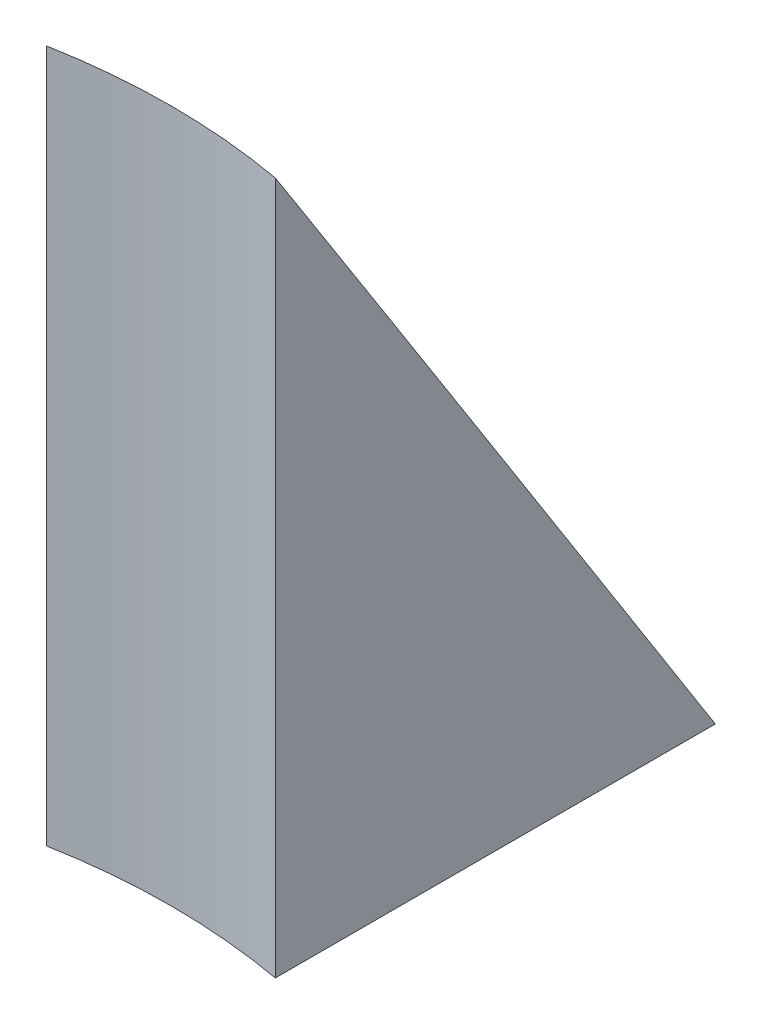
ISO-10303-21;
HEADER;
FILE_DESCRIPTION(('STEP AP214'),'2;1');
FILE_NAME('part.step','',(''),(''),'','','');
FILE_SCHEMA(('AUTOMOTIVE_DESIGN { 1 0 10303 214 1 1 1 1 }'));
ENDSEC;
DATA;
#1=APPLICATION_CONTEXT('core data for automotive mechanical design processes');
#2=APPLICATION_PROTOCOL_DEFINITION('international standard','automotive_design',2000,#1);
#3=PRODUCT_CONTEXT('',#1,'mechanical');
#4=PRODUCT('Part','Part','',(#3));
#5=PRODUCT_RELATED_PRODUCT_CATEGORY('part','',(#4));
#6=PRODUCT_DEFINITION_FORMATION('','',#4);
#7=PRODUCT_DEFINITION_CONTEXT('part definition',#1,'design');
#8=PRODUCT_DEFINITION('design','',#6,#7);
#9=PRODUCT_DEFINITION_SHAPE('','',#8);
#10=(LENGTH_UNIT() NAMED_UNIT(*) SI_UNIT(.MILLI.,.METRE.));
#11=(NAMED_UNIT(*) PLANE_ANGLE_UNIT() SI_UNIT($,.RADIAN.));
#12=(NAMED_UNIT(*) SI_UNIT($,.STERADIAN.) SOLID_ANGLE_UNIT());
#13=UNCERTAINTY_MEASURE_WITH_UNIT(LENGTH_MEASURE(1.E-05),#10,'distance_accuracy_value','');
#14=(GEOMETRIC_REPRESENTATION_CONTEXT(3) GLOBAL_UNCERTAINTY_ASSIGNED_CONTEXT((#13)) GLOBAL_UNIT_ASSIGNED_CONTEXT((#10,
#11,#12)) REPRESENTATION_CONTEXT('',''));
#15=CARTESIAN_POINT('',(0.,0.,0.));
#16=DIRECTION('',(0.,0.,1.));
#17=DIRECTION('',(1.,0.,0.));
#18=AXIS2_PLACEMENT_3D('',#15,#16,#17);
#19=CARTESIAN_POINT('',(75.,0.,0.));
#20=DIRECTION('',(0.,-1.,0.));
#21=DIRECTION('',(0.,0.,-1.));
#22=AXIS2_PLACEMENT_3D('',#19,#20,#21);
#23=PLANE('',#22);
#24=CARTESIAN_POINT('',(0.,0.,0.));
#25=DIRECTION('',(0.,-1.,0.));
#26=DIRECTION('',(0.,0.,-1.));
#27=AXIS2_PLACEMENT_3D('',#24,#25,#26);
#28=CIRCLE('',#27,75.);
#29=CARTESIAN_POINT('',(-7.99999999999999,0.,-74.5721127500086));
#30=VERTEX_POINT('',#29);
#31=CARTESIAN_POINT('',(8.00000000000002,0.,-74.5721127500086));
#32=VERTEX_POINT('',#31);
#33=EDGE_CURVE('E89',#30,#32,#28,.T.);
#34=ORIENTED_EDGE('',*,*,#33,.T.);
#35=DIRECTION('',(0.,0.,1.));
#36=VECTOR('',#35,1.);
#37=CARTESIAN_POINT('',(8.00000000000001,0.,-28.1269021383831));
#38=LINE('',#37,#36);
#39=CARTESIAN_POINT('',(8.00000000000002,0.,-43.7749928612216));
#40=VERTEX_POINT('',#39);
#41=EDGE_CURVE('E54',#32,#40,#38,.T.);
#42=ORIENTED_EDGE('',*,*,#41,.T.);
#43=CARTESIAN_POINT('',(0.,0.,0.));
#44=DIRECTION('',(0.,-1.,0.));
#45=DIRECTION('',(0.,0.,-1.));
#46=AXIS2_PLACEMENT_3D('',#43,#44,#45);
#47=CIRCLE('',#46,44.5);
#48=CARTESIAN_POINT('',(-7.99999999999999,0.,-43.7749928612216));
#49=VERTEX_POINT('',#48);
#50=EDGE_CURVE('E83',#49,#40,#47,.T.);
#51=ORIENTED_EDGE('',*,*,#50,.F.);
#52=DIRECTION('',(0.,0.,-1.));
#53=VECTOR('',#52,1.);
#54=CARTESIAN_POINT('',(-7.99999999999999,0.,-28.1269021383831));
#55=LINE('',#54,#53);
#56=EDGE_CURVE('E71',#49,#30,#55,.T.);
#57=ORIENTED_EDGE('',*,*,#56,.T.);
#58=EDGE_LOOP('',(#34,#42,#51,#57));
#59=FACE_BOUND('',#58,.T.);
#60=ADVANCED_FACE('F35',(#59),#23,.T.);
#61=CARTESIAN_POINT('',(0.,0.,0.));
#62=DIRECTION('',(0.,-1.,0.));
#63=DIRECTION('',(0.,0.,-1.));
#64=AXIS2_PLACEMENT_3D('',#61,#62,#63);
#65=CYLINDRICAL_SURFACE('',#64,44.5);
#66=ORIENTED_EDGE('',*,*,#50,.T.);
#67=DIRECTION('',(0.,-1.,0.));
#68=VECTOR('',#67,1.);
#69=CARTESIAN_POINT('',(8.00000000000001,0.,-43.7749928612216));
#70=LINE('',#69,#68);
#71=CARTESIAN_POINT('',(8.00000000000002,48.5,-43.7749928612216));
#72=VERTEX_POINT('',#71);
#73=EDGE_CURVE('E86',#40,#72,#70,.F.);
#74=ORIENTED_EDGE('',*,*,#73,.T.);
#75=CARTESIAN_POINT('',(0.,48.5,0.));
#76=DIRECTION('',(0.,-1.,0.));
#77=DIRECTION('',(0.,0.,-1.));
#78=AXIS2_PLACEMENT_3D('',#75,#76,#77);
#79=CIRCLE('',#78,44.5);
#80=CARTESIAN_POINT('',(-7.99999999999999,48.5,-43.7749928612216));
#81=VERTEX_POINT('',#80);
#82=EDGE_CURVE('E85',#81,#72,#79,.T.);
#83=ORIENTED_EDGE('',*,*,#82,.F.);
#84=DIRECTION('',(0.,-1.,0.));
#85=VECTOR('',#84,1.);
#86=CARTESIAN_POINT('',(-7.99999999999998,0.,-43.7749928612216));
#87=LINE('',#86,#85);
#88=EDGE_CURVE('E61',#81,#49,#87,.T.);
#89=ORIENTED_EDGE('',*,*,#88,.T.);
#90=EDGE_LOOP('',(#66,#74,#83,#89));
#91=FACE_BOUND('',#90,.T.);
#92=ADVANCED_FACE('F81',(#91),#65,.F.);
#93=CARTESIAN_POINT('',(0.,0.,0.));
#94=DIRECTION('',(0.,-1.,0.));
#95=DIRECTION('',(0.,0.,-1.));
#96=AXIS2_PLACEMENT_3D('',#93,#94,#95);
#97=CONICAL_SURFACE('',#96,75.,0.561374516359525);
#98=ORIENTED_EDGE('',*,*,#82,.T.);
#99=CARTESIAN_POINT('',(8.00000000000001,84.4557822020035,-20.3743025049298));
#100=CARTESIAN_POINT('',(8.00000000000001,83.9625246331272,-20.707543710608));
#101=CARTESIAN_POINT('',(8.00000000000001,83.4687678614849,-21.0400446819076));
#102=CARTESIAN_POINT('',(8.00000000000001,82.4803741326519,-21.7037340600182));
#103=CARTESIAN_POINT('',(8.00000000000001,81.9857371770443,-22.0349224691865));
#104=CARTESIAN_POINT('',(8.00000000000001,80.5006883825689,-23.0267673709304));
#105=CARTESIAN_POINT('',(8.00000000000001,79.5091309589703,-23.685708703122));
#106=CARTESIAN_POINT('',(8.00000000000001,77.5236681930282,-24.9999929014409));
#107=CARTESIAN_POINT('',(8.00000000000001,76.5297629036676,-25.6553358476821));
#108=CARTESIAN_POINT('',(8.00000000000001,74.5400659701677,-26.963155762155));
#109=CARTESIAN_POINT('',(8.00000000000001,73.544274321776,-27.6156327239151));
#110=CARTESIAN_POINT('',(8.00000000000001,71.5512094924838,-28.9182326060975));
#111=CARTESIAN_POINT('',(8.00000000000001,70.5539363719342,-29.5683556188951));
#112=CARTESIAN_POINT('',(8.00000000000001,68.5581408052112,-30.8666815020276));
#113=CARTESIAN_POINT('',(8.00000000000001,67.5596183585275,-31.5148843715781));
#114=CARTESIAN_POINT('',(8.00000000000002,64.562492714467,-33.4571169653446));
#115=CARTESIAN_POINT('',(8.00000000000001,62.5623443155775,-34.7487621245115));
#116=CARTESIAN_POINT('',(8.00000000000001,58.3276178270663,-37.4766561057027));
#117=CARTESIAN_POINT('',(8.00000000000002,56.0926829087125,-38.9123505696114));
#118=CARTESIAN_POINT('',(8.00000000000002,51.6202145485509,-41.7796874142503));
#119=CARTESIAN_POINT('',(8.00000000000002,49.382681105389,-43.2113297928674));
#120=CARTESIAN_POINT('',(8.00000000000002,44.9056954160839,-46.0716023400801));
#121=CARTESIAN_POINT('',(8.00000000000002,42.6662431730398,-47.5002325135279));
#122=CARTESIAN_POINT('',(8.00000000000002,38.1858751028958,-50.3551963790481));
#123=CARTESIAN_POINT('',(8.00000000000002,35.9449592755615,-51.7815300707526));
#124=CARTESIAN_POINT('',(8.00000000000002,31.4618964638,-54.6324646911741));
#125=CARTESIAN_POINT('',(8.00000000000002,29.2197494325547,-56.0570655462601));
#126=CARTESIAN_POINT('',(8.00000000000002,24.7345488753417,-58.904839633985));
#127=CARTESIAN_POINT('',(8.00000000000002,22.4914953493265,-60.3280128665493));
#128=CARTESIAN_POINT('',(8.00000000000002,15.7612487373712,-64.5958173632837));
#129=CARTESIAN_POINT('',(8.00000000000002,11.2729684812071,-67.4387341486832));
#130=CARTESIAN_POINT('',(8.00000000000002,3.53321360862604,-72.3374219973603));
#131=CARTESIAN_POINT('',(8.00000000000002,0.282205388926721,-74.3939302047278));
#132=CARTESIAN_POINT('',(8.00000000000002,-6.22062092358304,-78.5056659290424));
#133=CARTESIAN_POINT('',(8.00000000000003,-9.47243901640848,-80.5608934459659));
#134=CARTESIAN_POINT('',(8.00000000000003,-19.2288445382535,-86.7250719598417));
#135=CARTESIAN_POINT('',(8.00000000000003,-25.7343824771011,-90.8325184558092));
#136=CARTESIAN_POINT('',(8.00000000000003,-38.7466229862275,-99.0444639557273));
#137=CARTESIAN_POINT('',(8.00000000000003,-45.2533254295172,-103.148963160933));
#138=CARTESIAN_POINT('',(8.00000000000003,-55.0142510593218,-109.304326619775));
#139=CARTESIAN_POINT('',(8.00000000000003,-58.2680376940431,-111.355883189076));
#140=CARTESIAN_POINT('',(8.00000000000003,-64.7758603188106,-115.458600707749));
#141=CARTESIAN_POINT('',(8.00000000000004,-68.0298963088537,-117.509761657128));
#142=CARTESIAN_POINT('',(8.00000000000004,-71.2840361776368,-119.560757783817));
#143=B_SPLINE_CURVE_WITH_KNOTS('',3,(#99,#100,#101,#102,#103,#104,#105,#106,#107,#108,#109,#110,
#111,#112,#113,#114,#115,#116,#117,#118,#119,#120,#121,#122,#123,#124,#125,#126,#127,#128,#129,
#130,#131,#132,#133,#134,#135,#136,#137,#138,#139,#140,#141,#142),.UNSPECIFIED.,.F.,.F.,(4,2,2,
2,2,2,2,2,2,2,2,2,2,2,2,2,2,2,2,2,2,4),(0.,1.78582420718769,3.57164520565107,7.1432594935377,
10.7147939383599,14.2863364437375,17.8577372394581,21.4291394942453,28.5719909399824,
36.5410112752994,44.5100357652049,52.4790474082473,60.4480603278988,68.4174007958916,
76.3867416811978,92.3254194126441,103.865979132632,115.406539066284,138.487661537655,
161.567020197197,173.106695489008,184.646370637025),.UNSPECIFIED.);
#144=EDGE_CURVE('E12',#72,#32,#143,.T.);
#145=ORIENTED_EDGE('',*,*,#144,.T.);
#146=ORIENTED_EDGE('',*,*,#33,.F.);
#147=CARTESIAN_POINT('',(-7.99999999999999,-71.2840361776368,-119.560757783817));
#148=CARTESIAN_POINT('',(-7.99999999999999,-68.0297378440932,-117.509661755299));
#149=CARTESIAN_POINT('',(-7.99999999999999,-64.7755433814998,-115.458400915408));
#150=CARTESIAN_POINT('',(-7.99999999999999,-58.2674039246734,-111.355483628616));
#151=CARTESIAN_POINT('',(-7.99999999999999,-55.0134589304369,-109.30382718172));
#152=CARTESIAN_POINT('',(-7.99999999999999,-45.2520872799535,-103.148182190628));
#153=CARTESIAN_POINT('',(-7.99999999999999,-38.745097272654,-99.0435011797939));
#154=CARTESIAN_POINT('',(-7.99999999999999,-25.7328850145729,-90.8315733207909));
#155=CARTESIAN_POINT('',(-7.99999999999999,-19.2276627366233,-86.724326515679));
#156=CARTESIAN_POINT('',(-7.99999999999999,-9.47171854062209,-80.5604376309975));
#157=CARTESIAN_POINT('',(-7.99999999999999,-6.2200455993079,-78.5053008327324));
#158=CARTESIAN_POINT('',(-7.99999999999999,0.28249351599541,-74.3937493409585));
#159=CARTESIAN_POINT('',(-7.99999999999999,3.53335968977483,-72.337334647118));
#160=CARTESIAN_POINT('',(-7.99999999999999,10.03415632176,-68.2228047858646));
#161=CARTESIAN_POINT('',(-7.99999999999999,13.2840867479976,-66.1646895679389));
#162=CARTESIAN_POINT('',(-7.99999999999999,19.7825818704411,-62.046310229553));
#163=CARTESIAN_POINT('',(-7.99999999999999,23.031146567875,-59.9860461110309));
#164=CARTESIAN_POINT('',(-7.99999999999999,29.526395938852,-55.8626330538666));
#165=CARTESIAN_POINT('',(-7.99999999999999,32.7730806321888,-53.7994841464079));
#166=CARTESIAN_POINT('',(-7.99999999999999,39.2638883246152,-49.6691350805311));
#167=CARTESIAN_POINT('',(-7.99999999999999,42.5080113152719,-47.6019349088542));
#168=CARTESIAN_POINT('',(-7.99999999999999,47.3714136645839,-44.4966443101994));
#169=CARTESIAN_POINT('',(-7.99999999999999,48.9921141798261,-43.460779764759));
#170=CARTESIAN_POINT('',(-7.99999999999999,52.2323339661412,-41.38720606612));
#171=CARTESIAN_POINT('',(-7.99999999999999,53.8518532377493,-40.3494969137577));
#172=CARTESIAN_POINT('',(-7.99999999999999,57.0893973742281,-38.2717832258874));
#173=CARTESIAN_POINT('',(-7.99999999999999,58.7074222531131,-37.2317787122214));
#174=CARTESIAN_POINT('',(-7.99999999999999,61.9415824706703,-35.1488285077351));
#175=CARTESIAN_POINT('',(-7.99999999999999,63.5577178060518,-34.1058828118035));
#176=CARTESIAN_POINT('',(-7.99999999999999,66.7875785721334,-32.0161155060209));
#177=CARTESIAN_POINT('',(-7.99999999999999,68.4013038978438,-30.9692937338485));
#178=CARTESIAN_POINT('',(-7.99999999999999,71.6254217820235,-28.8705417866172));
#179=CARTESIAN_POINT('',(-7.99999999999999,73.2358143565684,-27.818611636281));
#180=CARTESIAN_POINT('',(-7.99999999999999,75.6479386076889,-26.2353783266388));
#181=CARTESIAN_POINT('',(-7.99999999999999,76.4514161621947,-25.7067352149223));
#182=CARTESIAN_POINT('',(-7.99999999999999,78.0569630193172,-24.6473167274819));
#183=CARTESIAN_POINT('',(-7.99999999999999,78.859032324024,-24.1165413549262));
#184=CARTESIAN_POINT('',(-7.99999999999999,80.461485893425,-23.0524230767318));
#185=CARTESIAN_POINT('',(-7.99999999999999,81.2618701306717,-22.5190801297285));
#186=CARTESIAN_POINT('',(-7.99999999999999,82.8605211643923,-21.4492222267204));
#187=CARTESIAN_POINT('',(-7.99999999999999,83.6587879499793,-20.912707254452));
#188=CARTESIAN_POINT('',(-7.99999999999999,84.4557822020035,-20.3743025049298));
#189=B_SPLINE_CURVE_WITH_KNOTS('',3,(#147,#148,#149,#150,#151,#152,#153,#154,#155,#156,#157,
#158,#159,#160,#161,#162,#163,#164,#165,#166,#167,#168,#169,#170,#171,#172,#173,#174,#175,#176,
#177,#178,#179,#180,#181,#182,#183,#184,#185,#186,#187,#188),.UNSPECIFIED.,.F.,.F.,(4,2,2,2,2,2,
2,2,2,2,2,2,2,2,2,2,2,2,2,2,4),(0.,11.5402371305304,23.0804740973392,46.1608534104135,
69.2408552883463,80.7809017581356,92.3209512243974,103.861356777232,115.401751931265,
126.942023287375,138.482332475085,144.252701510405,150.023067929843,155.793379674752,
161.563701453732,167.334267677427,173.104806001444,175.990172856694,178.875535426183,
181.760944636567,184.646368653769),.UNSPECIFIED.);
#190=EDGE_CURVE('E47',#30,#81,#189,.T.);
#191=ORIENTED_EDGE('',*,*,#190,.T.);
#192=EDGE_LOOP('',(#98,#145,#146,#191));
#193=FACE_BOUND('',#192,.T.);
#194=ADVANCED_FACE('F96',(#193),#97,.T.);
#195=CARTESIAN_POINT('',(-7.99999999999999,48.5,-28.1269021383831));
#196=DIRECTION('',(-1.,0.,0.));
#197=DIRECTION('',(0.,0.,1.));
#198=AXIS2_PLACEMENT_3D('',#195,#196,#197);
#199=PLANE('',#198);
#200=ORIENTED_EDGE('',*,*,#190,.F.);
#201=ORIENTED_EDGE('',*,*,#56,.F.);
#202=ORIENTED_EDGE('',*,*,#88,.F.);
#203=EDGE_LOOP('',(#200,#201,#202));
#204=FACE_BOUND('',#203,.T.);
#205=ADVANCED_FACE('F72',(#204),#199,.T.);
#206=CARTESIAN_POINT('',(8.00000000000001,48.5,-28.1269021383831));
#207=DIRECTION('',(1.,0.,0.));
#208=DIRECTION('',(0.,0.,-1.));
#209=AXIS2_PLACEMENT_3D('',#206,#207,#208);
#210=PLANE('',#209);
#211=ORIENTED_EDGE('',*,*,#41,.F.);
#212=ORIENTED_EDGE('',*,*,#144,.F.);
#213=ORIENTED_EDGE('',*,*,#73,.F.);
#214=EDGE_LOOP('',(#211,#212,#213));
#215=FACE_BOUND('',#214,.T.);
#216=ADVANCED_FACE('F100',(#215),#210,.T.);
#217=CLOSED_SHELL('',(#60,#92,#194,#205,#216));
#218=MANIFOLD_SOLID_BREP('B2',#217);
#219=ADVANCED_BREP_SHAPE_REPRESENTATION('',(#18,#218),#14);
#220=SHAPE_DEFINITION_REPRESENTATION(#9,#219);
ENDSEC;
END-ISO-10303-21;
